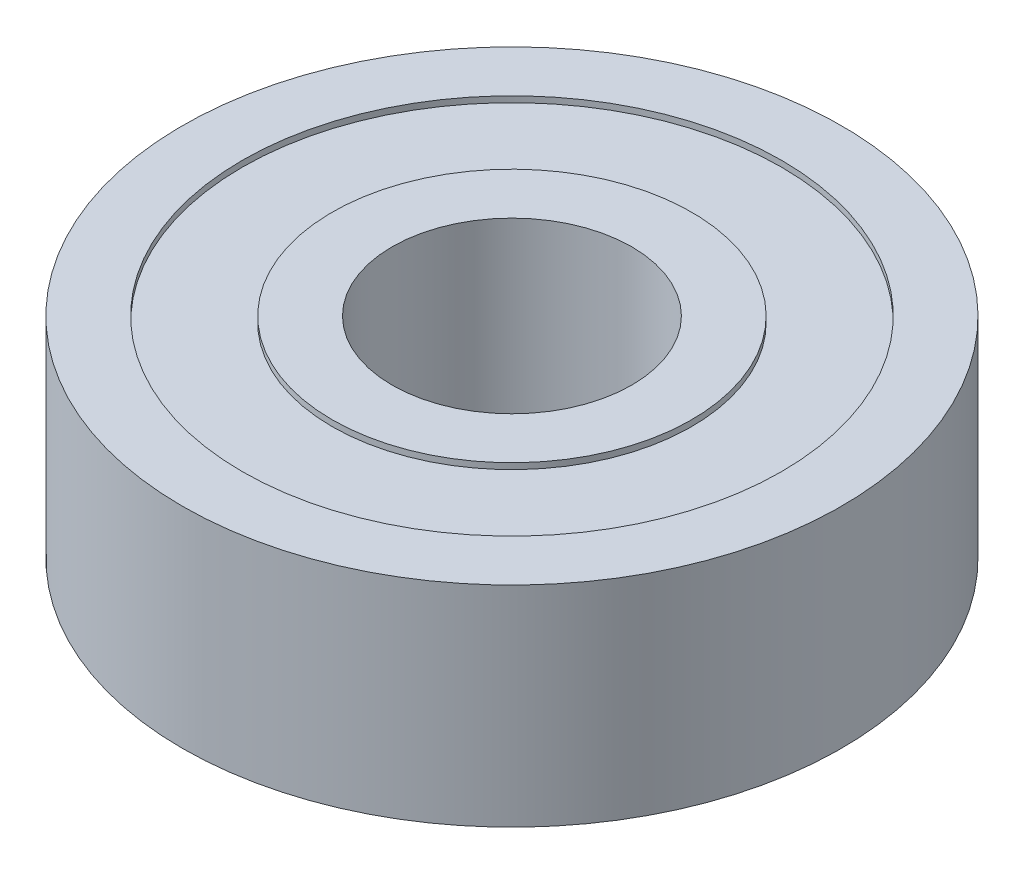
ISO-10303-21;
HEADER;
FILE_DESCRIPTION(('STEP AP214'),'2;1');
FILE_NAME('part.step','',(''),(''),'','','');
FILE_SCHEMA(('AUTOMOTIVE_DESIGN { 1 0 10303 214 1 1 1 1 }'));
ENDSEC;
DATA;
#1=APPLICATION_CONTEXT('core data for automotive mechanical design processes');
#2=APPLICATION_PROTOCOL_DEFINITION('international standard','automotive_design',2000,#1);
#3=PRODUCT_CONTEXT('',#1,'mechanical');
#4=PRODUCT('Part','Part','',(#3));
#5=PRODUCT_RELATED_PRODUCT_CATEGORY('part','',(#4));
#6=PRODUCT_DEFINITION_FORMATION('','',#4);
#7=PRODUCT_DEFINITION_CONTEXT('part definition',#1,'design');
#8=PRODUCT_DEFINITION('design','',#6,#7);
#9=PRODUCT_DEFINITION_SHAPE('','',#8);
#10=(LENGTH_UNIT() NAMED_UNIT(*) SI_UNIT(.MILLI.,.METRE.));
#11=(NAMED_UNIT(*) PLANE_ANGLE_UNIT() SI_UNIT($,.RADIAN.));
#12=(NAMED_UNIT(*) SI_UNIT($,.STERADIAN.) SOLID_ANGLE_UNIT());
#13=UNCERTAINTY_MEASURE_WITH_UNIT(LENGTH_MEASURE(1.E-05),#10,'distance_accuracy_value','');
#14=(GEOMETRIC_REPRESENTATION_CONTEXT(3) GLOBAL_UNCERTAINTY_ASSIGNED_CONTEXT((#13)) GLOBAL_UNIT_ASSIGNED_CONTEXT((#10,
#11,#12)) REPRESENTATION_CONTEXT('',''));
#15=CARTESIAN_POINT('',(0.,0.,0.));
#16=DIRECTION('',(0.,0.,1.));
#17=DIRECTION('',(1.,0.,0.));
#18=AXIS2_PLACEMENT_3D('',#15,#16,#17);
#19=CARTESIAN_POINT('',(0.,19.3457223953488,0.));
#20=DIRECTION('',(0.,1.,0.));
#21=DIRECTION('',(0.,0.,1.));
#22=AXIS2_PLACEMENT_3D('',#19,#20,#21);
#23=CYLINDRICAL_SURFACE('',#22,4.);
#24=CARTESIAN_POINT('',(0.,7.,0.));
#25=DIRECTION('',(0.,1.,0.));
#26=DIRECTION('',(0.,0.,1.));
#27=AXIS2_PLACEMENT_3D('',#24,#25,#26);
#28=CIRCLE('',#27,4.);
#29=CARTESIAN_POINT('',(0.,7.,4.));
#30=VERTEX_POINT('',#29);
#31=EDGE_CURVE('E84',#30,#30,#28,.T.);
#32=ORIENTED_EDGE('',*,*,#31,.T.);
#33=EDGE_LOOP('',(#32));
#34=FACE_BOUND('',#33,.T.);
#35=CARTESIAN_POINT('',(0.,0.,0.));
#36=DIRECTION('',(0.,1.,0.));
#37=DIRECTION('',(0.,0.,1.));
#38=AXIS2_PLACEMENT_3D('',#35,#36,#37);
#39=CIRCLE('',#38,4.);
#40=CARTESIAN_POINT('',(0.,0.,4.));
#41=VERTEX_POINT('',#40);
#42=EDGE_CURVE('E12',#41,#41,#39,.T.);
#43=ORIENTED_EDGE('',*,*,#42,.F.);
#44=EDGE_LOOP('',(#43));
#45=FACE_BOUND('',#44,.T.);
#46=ADVANCED_FACE('F44',(#34,#45),#23,.F.);
#47=CARTESIAN_POINT('',(-4.,0.,0.));
#48=DIRECTION('',(0.,-1.,0.));
#49=DIRECTION('',(0.,0.,-1.));
#50=AXIS2_PLACEMENT_3D('',#47,#48,#49);
#51=PLANE('',#50);
#52=ORIENTED_EDGE('',*,*,#42,.T.);
#53=EDGE_LOOP('',(#52));
#54=FACE_BOUND('',#53,.T.);
#55=CARTESIAN_POINT('',(0.,0.,0.));
#56=DIRECTION('',(0.,1.,0.));
#57=DIRECTION('',(0.,0.,1.));
#58=AXIS2_PLACEMENT_3D('',#55,#56,#57);
#59=CIRCLE('',#58,6.);
#60=CARTESIAN_POINT('',(0.,0.,6.));
#61=VERTEX_POINT('',#60);
#62=EDGE_CURVE('E50',#61,#61,#59,.T.);
#63=ORIENTED_EDGE('',*,*,#62,.F.);
#64=EDGE_LOOP('',(#63));
#65=FACE_BOUND('',#64,.T.);
#66=ADVANCED_FACE('F102',(#54,#65),#51,.T.);
#67=CARTESIAN_POINT('',(0.,19.3457223953488,0.));
#68=DIRECTION('',(0.,1.,0.));
#69=DIRECTION('',(0.,0.,1.));
#70=AXIS2_PLACEMENT_3D('',#67,#68,#69);
#71=CYLINDRICAL_SURFACE('',#70,6.);
#72=ORIENTED_EDGE('',*,*,#62,.T.);
#73=EDGE_LOOP('',(#72));
#74=FACE_BOUND('',#73,.T.);
#75=CARTESIAN_POINT('',(0.,0.199999999999999,0.));
#76=DIRECTION('',(0.,1.,0.));
#77=DIRECTION('',(0.,0.,1.));
#78=AXIS2_PLACEMENT_3D('',#75,#76,#77);
#79=CIRCLE('',#78,6.);
#80=CARTESIAN_POINT('',(0.,0.199999999999999,6.));
#81=VERTEX_POINT('',#80);
#82=EDGE_CURVE('E54',#81,#81,#79,.T.);
#83=ORIENTED_EDGE('',*,*,#82,.F.);
#84=EDGE_LOOP('',(#83));
#85=FACE_BOUND('',#84,.T.);
#86=ADVANCED_FACE('F106',(#74,#85),#71,.T.);
#87=CARTESIAN_POINT('',(-6.,0.2,0.));
#88=DIRECTION('',(0.,-1.,0.));
#89=DIRECTION('',(0.,0.,-1.));
#90=AXIS2_PLACEMENT_3D('',#87,#88,#89);
#91=PLANE('',#90);
#92=ORIENTED_EDGE('',*,*,#82,.T.);
#93=EDGE_LOOP('',(#92));
#94=FACE_BOUND('',#93,.T.);
#95=CARTESIAN_POINT('',(0.,0.199999999999999,0.));
#96=DIRECTION('',(0.,1.,0.));
#97=DIRECTION('',(0.,0.,1.));
#98=AXIS2_PLACEMENT_3D('',#95,#96,#97);
#99=CIRCLE('',#98,9.);
#100=CARTESIAN_POINT('',(0.,0.199999999999999,9.));
#101=VERTEX_POINT('',#100);
#102=EDGE_CURVE('E58',#101,#101,#99,.T.);
#103=ORIENTED_EDGE('',*,*,#102,.F.);
#104=EDGE_LOOP('',(#103));
#105=FACE_BOUND('',#104,.T.);
#106=ADVANCED_FACE('F110',(#94,#105),#91,.T.);
#107=CARTESIAN_POINT('',(0.,19.3457223953488,0.));
#108=DIRECTION('',(0.,1.,0.));
#109=DIRECTION('',(0.,0.,1.));
#110=AXIS2_PLACEMENT_3D('',#107,#108,#109);
#111=CYLINDRICAL_SURFACE('',#110,9.);
#112=ORIENTED_EDGE('',*,*,#102,.T.);
#113=EDGE_LOOP('',(#112));
#114=FACE_BOUND('',#113,.T.);
#115=CARTESIAN_POINT('',(0.,0.,0.));
#116=DIRECTION('',(0.,1.,0.));
#117=DIRECTION('',(0.,0.,1.));
#118=AXIS2_PLACEMENT_3D('',#115,#116,#117);
#119=CIRCLE('',#118,9.);
#120=CARTESIAN_POINT('',(0.,0.,9.));
#121=VERTEX_POINT('',#120);
#122=EDGE_CURVE('E63',#121,#121,#119,.T.);
#123=ORIENTED_EDGE('',*,*,#122,.F.);
#124=EDGE_LOOP('',(#123));
#125=FACE_BOUND('',#124,.T.);
#126=ADVANCED_FACE('F116',(#114,#125),#111,.F.);
#127=CARTESIAN_POINT('',(-9.,0.,0.));
#128=DIRECTION('',(0.,-1.,0.));
#129=DIRECTION('',(0.,0.,-1.));
#130=AXIS2_PLACEMENT_3D('',#127,#128,#129);
#131=PLANE('',#130);
#132=ORIENTED_EDGE('',*,*,#122,.T.);
#133=EDGE_LOOP('',(#132));
#134=FACE_BOUND('',#133,.T.);
#135=CARTESIAN_POINT('',(0.,0.,0.));
#136=DIRECTION('',(0.,1.,0.));
#137=DIRECTION('',(0.,0.,1.));
#138=AXIS2_PLACEMENT_3D('',#135,#136,#137);
#139=CIRCLE('',#138,11.);
#140=CARTESIAN_POINT('',(0.,0.,11.));
#141=VERTEX_POINT('',#140);
#142=EDGE_CURVE('E66',#141,#141,#139,.T.);
#143=ORIENTED_EDGE('',*,*,#142,.F.);
#144=EDGE_LOOP('',(#143));
#145=FACE_BOUND('',#144,.T.);
#146=ADVANCED_FACE('F120',(#134,#145),#131,.T.);
#147=CARTESIAN_POINT('',(0.,19.3457223953488,0.));
#148=DIRECTION('',(0.,1.,0.));
#149=DIRECTION('',(0.,0.,1.));
#150=AXIS2_PLACEMENT_3D('',#147,#148,#149);
#151=CYLINDRICAL_SURFACE('',#150,11.);
#152=ORIENTED_EDGE('',*,*,#142,.T.);
#153=EDGE_LOOP('',(#152));
#154=FACE_BOUND('',#153,.T.);
#155=CARTESIAN_POINT('',(0.,7.,0.));
#156=DIRECTION('',(0.,1.,0.));
#157=DIRECTION('',(0.,0.,1.));
#158=AXIS2_PLACEMENT_3D('',#155,#156,#157);
#159=CIRCLE('',#158,11.);
#160=CARTESIAN_POINT('',(0.,7.,11.));
#161=VERTEX_POINT('',#160);
#162=EDGE_CURVE('E69',#161,#161,#159,.T.);
#163=ORIENTED_EDGE('',*,*,#162,.F.);
#164=EDGE_LOOP('',(#163));
#165=FACE_BOUND('',#164,.T.);
#166=ADVANCED_FACE('F124',(#154,#165),#151,.T.);
#167=CARTESIAN_POINT('',(-11.,7.,0.));
#168=DIRECTION('',(0.,1.,0.));
#169=DIRECTION('',(0.,0.,1.));
#170=AXIS2_PLACEMENT_3D('',#167,#168,#169);
#171=PLANE('',#170);
#172=ORIENTED_EDGE('',*,*,#162,.T.);
#173=EDGE_LOOP('',(#172));
#174=FACE_BOUND('',#173,.T.);
#175=CARTESIAN_POINT('',(0.,7.,0.));
#176=DIRECTION('',(0.,1.,0.));
#177=DIRECTION('',(0.,0.,1.));
#178=AXIS2_PLACEMENT_3D('',#175,#176,#177);
#179=CIRCLE('',#178,9.);
#180=CARTESIAN_POINT('',(0.,7.,9.));
#181=VERTEX_POINT('',#180);
#182=EDGE_CURVE('E72',#181,#181,#179,.T.);
#183=ORIENTED_EDGE('',*,*,#182,.F.);
#184=EDGE_LOOP('',(#183));
#185=FACE_BOUND('',#184,.T.);
#186=ADVANCED_FACE('F128',(#174,#185),#171,.T.);
#187=CARTESIAN_POINT('',(0.,19.3457223953488,0.));
#188=DIRECTION('',(0.,1.,0.));
#189=DIRECTION('',(0.,0.,1.));
#190=AXIS2_PLACEMENT_3D('',#187,#188,#189);
#191=CYLINDRICAL_SURFACE('',#190,9.);
#192=ORIENTED_EDGE('',*,*,#182,.T.);
#193=EDGE_LOOP('',(#192));
#194=FACE_BOUND('',#193,.T.);
#195=CARTESIAN_POINT('',(0.,6.8,0.));
#196=DIRECTION('',(0.,1.,0.));
#197=DIRECTION('',(0.,0.,1.));
#198=AXIS2_PLACEMENT_3D('',#195,#196,#197);
#199=CIRCLE('',#198,9.);
#200=CARTESIAN_POINT('',(0.,6.8,9.));
#201=VERTEX_POINT('',#200);
#202=EDGE_CURVE('E75',#201,#201,#199,.T.);
#203=ORIENTED_EDGE('',*,*,#202,.F.);
#204=EDGE_LOOP('',(#203));
#205=FACE_BOUND('',#204,.T.);
#206=ADVANCED_FACE('F132',(#194,#205),#191,.F.);
#207=CARTESIAN_POINT('',(-9.,6.8,0.));
#208=DIRECTION('',(0.,1.,0.));
#209=DIRECTION('',(0.,0.,1.));
#210=AXIS2_PLACEMENT_3D('',#207,#208,#209);
#211=PLANE('',#210);
#212=ORIENTED_EDGE('',*,*,#202,.T.);
#213=EDGE_LOOP('',(#212));
#214=FACE_BOUND('',#213,.T.);
#215=CARTESIAN_POINT('',(0.,6.8,0.));
#216=DIRECTION('',(0.,1.,0.));
#217=DIRECTION('',(0.,0.,1.));
#218=AXIS2_PLACEMENT_3D('',#215,#216,#217);
#219=CIRCLE('',#218,6.);
#220=CARTESIAN_POINT('',(0.,6.8,6.));
#221=VERTEX_POINT('',#220);
#222=EDGE_CURVE('E78',#221,#221,#219,.T.);
#223=ORIENTED_EDGE('',*,*,#222,.F.);
#224=EDGE_LOOP('',(#223));
#225=FACE_BOUND('',#224,.T.);
#226=ADVANCED_FACE('F98',(#214,#225),#211,.T.);
#227=CARTESIAN_POINT('',(0.,19.3457223953488,0.));
#228=DIRECTION('',(0.,1.,0.));
#229=DIRECTION('',(0.,0.,1.));
#230=AXIS2_PLACEMENT_3D('',#227,#228,#229);
#231=CYLINDRICAL_SURFACE('',#230,6.);
#232=ORIENTED_EDGE('',*,*,#222,.T.);
#233=EDGE_LOOP('',(#232));
#234=FACE_BOUND('',#233,.T.);
#235=CARTESIAN_POINT('',(0.,7.,0.));
#236=DIRECTION('',(0.,1.,0.));
#237=DIRECTION('',(0.,0.,1.));
#238=AXIS2_PLACEMENT_3D('',#235,#236,#237);
#239=CIRCLE('',#238,6.);
#240=CARTESIAN_POINT('',(0.,7.,6.));
#241=VERTEX_POINT('',#240);
#242=EDGE_CURVE('E81',#241,#241,#239,.T.);
#243=ORIENTED_EDGE('',*,*,#242,.F.);
#244=EDGE_LOOP('',(#243));
#245=FACE_BOUND('',#244,.T.);
#246=ADVANCED_FACE('F92',(#234,#245),#231,.T.);
#247=CARTESIAN_POINT('',(-6.,7.,0.));
#248=DIRECTION('',(0.,1.,0.));
#249=DIRECTION('',(0.,0.,1.));
#250=AXIS2_PLACEMENT_3D('',#247,#248,#249);
#251=PLANE('',#250);
#252=ORIENTED_EDGE('',*,*,#242,.T.);
#253=EDGE_LOOP('',(#252));
#254=FACE_BOUND('',#253,.T.);
#255=ORIENTED_EDGE('',*,*,#31,.F.);
#256=EDGE_LOOP('',(#255));
#257=FACE_BOUND('',#256,.T.);
#258=ADVANCED_FACE('F90',(#254,#257),#251,.T.);
#259=CLOSED_SHELL('',(#46,#66,#86,#106,#126,#146,#166,#186,#206,#226,#246,#258));
#260=MANIFOLD_SOLID_BREP('B2',#259);
#261=ADVANCED_BREP_SHAPE_REPRESENTATION('',(#18,#260),#14);
#262=SHAPE_DEFINITION_REPRESENTATION(#9,#261);
ENDSEC;
END-ISO-10303-21;
